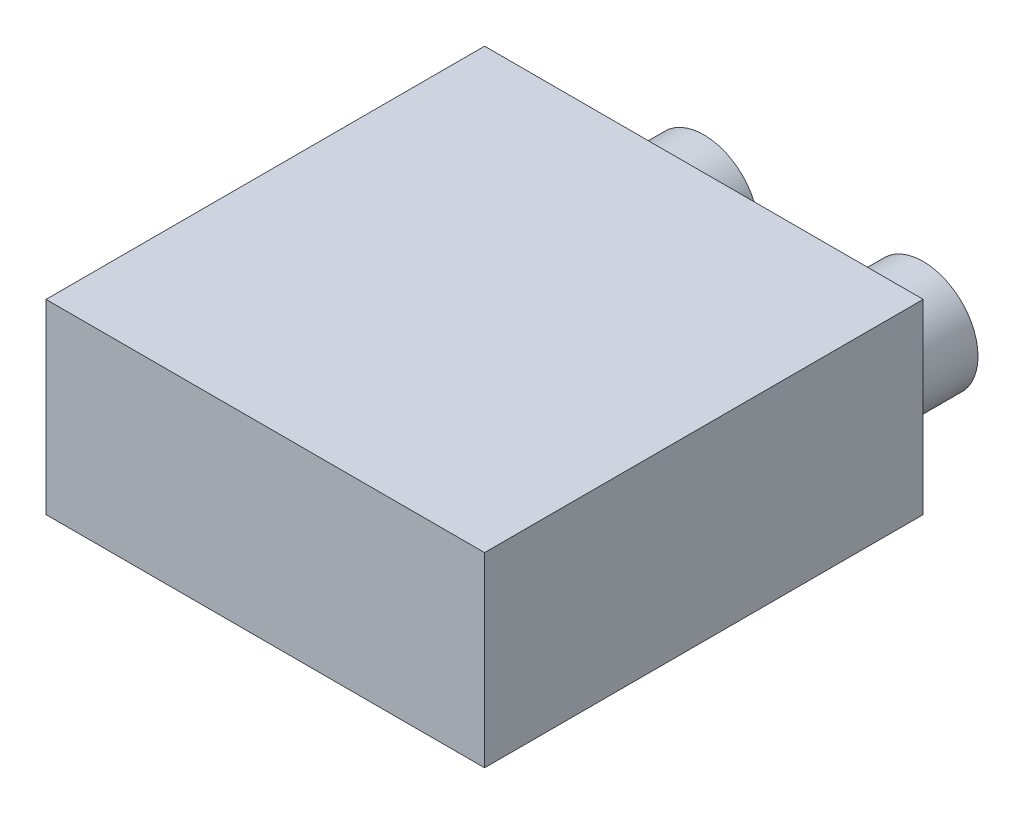
ISO-10303-21;
HEADER;
FILE_DESCRIPTION(('STEP AP214'),'2;1');
FILE_NAME('part.step','',(''),(''),'','','');
FILE_SCHEMA(('AUTOMOTIVE_DESIGN { 1 0 10303 214 1 1 1 1 }'));
ENDSEC;
DATA;
#1=APPLICATION_CONTEXT('core data for automotive mechanical design processes');
#2=APPLICATION_PROTOCOL_DEFINITION('international standard','automotive_design',2000,#1);
#3=PRODUCT_CONTEXT('',#1,'mechanical');
#4=PRODUCT('Part','Part','',(#3));
#5=PRODUCT_RELATED_PRODUCT_CATEGORY('part','',(#4));
#6=PRODUCT_DEFINITION_FORMATION('','',#4);
#7=PRODUCT_DEFINITION_CONTEXT('part definition',#1,'design');
#8=PRODUCT_DEFINITION('design','',#6,#7);
#9=PRODUCT_DEFINITION_SHAPE('','',#8);
#10=(LENGTH_UNIT() NAMED_UNIT(*) SI_UNIT(.MILLI.,.METRE.));
#11=(NAMED_UNIT(*) PLANE_ANGLE_UNIT() SI_UNIT($,.RADIAN.));
#12=(NAMED_UNIT(*) SI_UNIT($,.STERADIAN.) SOLID_ANGLE_UNIT());
#13=UNCERTAINTY_MEASURE_WITH_UNIT(LENGTH_MEASURE(1.E-05),#10,'distance_accuracy_value','');
#14=(GEOMETRIC_REPRESENTATION_CONTEXT(3) GLOBAL_UNCERTAINTY_ASSIGNED_CONTEXT((#13)) GLOBAL_UNIT_ASSIGNED_CONTEXT((#10,
#11,#12)) REPRESENTATION_CONTEXT('',''));
#15=CARTESIAN_POINT('',(0.,0.,0.));
#16=DIRECTION('',(0.,0.,1.));
#17=DIRECTION('',(1.,0.,0.));
#18=AXIS2_PLACEMENT_3D('',#15,#16,#17);
#19=CARTESIAN_POINT('',(20.,17.,-20.));
#20=DIRECTION('',(-1.,0.,0.));
#21=DIRECTION('',(0.,0.,1.));
#22=AXIS2_PLACEMENT_3D('',#19,#20,#21);
#23=PLANE('',#22);
#24=DIRECTION('',(0.,0.,-1.));
#25=VECTOR('',#24,1.);
#26=CARTESIAN_POINT('',(20.,0.,-20.));
#27=LINE('',#26,#25);
#28=CARTESIAN_POINT('',(20.,0.,20.));
#29=VERTEX_POINT('',#28);
#30=CARTESIAN_POINT('',(20.,0.,-20.));
#31=VERTEX_POINT('',#30);
#32=EDGE_CURVE('E105',#29,#31,#27,.T.);
#33=ORIENTED_EDGE('',*,*,#32,.T.);
#34=DIRECTION('',(0.,-1.,0.));
#35=VECTOR('',#34,1.);
#36=CARTESIAN_POINT('',(20.,17.,-20.));
#37=LINE('',#36,#35);
#38=CARTESIAN_POINT('',(20.,17.,-20.));
#39=VERTEX_POINT('',#38);
#40=EDGE_CURVE('E11',#39,#31,#37,.T.);
#41=ORIENTED_EDGE('',*,*,#40,.F.);
#42=DIRECTION('',(0.,0.,-1.));
#43=VECTOR('',#42,1.);
#44=CARTESIAN_POINT('',(20.,17.,-20.));
#45=LINE('',#44,#43);
#46=CARTESIAN_POINT('',(20.,17.,20.));
#47=VERTEX_POINT('',#46);
#48=EDGE_CURVE('E112',#47,#39,#45,.T.);
#49=ORIENTED_EDGE('',*,*,#48,.F.);
#50=DIRECTION('',(0.,-1.,0.));
#51=VECTOR('',#50,1.);
#52=CARTESIAN_POINT('',(20.,17.,20.));
#53=LINE('',#52,#51);
#54=EDGE_CURVE('E115',#47,#29,#53,.T.);
#55=ORIENTED_EDGE('',*,*,#54,.T.);
#56=EDGE_LOOP('',(#33,#41,#49,#55));
#57=FACE_BOUND('',#56,.T.);
#58=ADVANCED_FACE('F37',(#57),#23,.F.);
#59=CARTESIAN_POINT('',(-20.,17.,-20.));
#60=DIRECTION('',(0.,0.,1.));
#61=DIRECTION('',(1.,0.,0.));
#62=AXIS2_PLACEMENT_3D('',#59,#60,#61);
#63=PLANE('',#62);
#64=DIRECTION('',(-1.,0.,0.));
#65=VECTOR('',#64,1.);
#66=CARTESIAN_POINT('',(-20.,0.,-20.));
#67=LINE('',#66,#65);
#68=CARTESIAN_POINT('',(10.,0.,-20.));
#69=VERTEX_POINT('',#68);
#70=EDGE_CURVE('E97',#31,#69,#67,.T.);
#71=ORIENTED_EDGE('',*,*,#70,.T.);
#72=CARTESIAN_POINT('',(10.,5.,-20.));
#73=DIRECTION('',(0.,0.,1.));
#74=DIRECTION('',(1.,0.,0.));
#75=AXIS2_PLACEMENT_3D('',#72,#73,#74);
#76=CIRCLE('',#75,5.);
#77=EDGE_CURVE('E49',#69,#69,#76,.T.);
#78=ORIENTED_EDGE('',*,*,#77,.T.);
#79=CARTESIAN_POINT('',(-10.,0.,-20.));
#80=VERTEX_POINT('',#79);
#81=EDGE_CURVE('E90',#69,#80,#67,.T.);
#82=ORIENTED_EDGE('',*,*,#81,.T.);
#83=CARTESIAN_POINT('',(-10.,5.,-20.));
#84=DIRECTION('',(0.,0.,-1.));
#85=DIRECTION('',(-1.,0.,0.));
#86=AXIS2_PLACEMENT_3D('',#83,#84,#85);
#87=CIRCLE('',#86,5.);
#88=EDGE_CURVE('E95',#80,#80,#87,.T.);
#89=ORIENTED_EDGE('',*,*,#88,.F.);
#90=CARTESIAN_POINT('',(-20.,0.,-20.));
#91=VERTEX_POINT('',#90);
#92=EDGE_CURVE('E98',#80,#91,#67,.T.);
#93=ORIENTED_EDGE('',*,*,#92,.T.);
#94=DIRECTION('',(0.,-1.,0.));
#95=VECTOR('',#94,1.);
#96=CARTESIAN_POINT('',(-20.,17.,-20.));
#97=LINE('',#96,#95);
#98=CARTESIAN_POINT('',(-20.,17.,-20.));
#99=VERTEX_POINT('',#98);
#100=EDGE_CURVE('E44',#99,#91,#97,.T.);
#101=ORIENTED_EDGE('',*,*,#100,.F.);
#102=DIRECTION('',(-1.,0.,0.));
#103=VECTOR('',#102,1.);
#104=CARTESIAN_POINT('',(-20.,17.,-20.));
#105=LINE('',#104,#103);
#106=EDGE_CURVE('E85',#39,#99,#105,.T.);
#107=ORIENTED_EDGE('',*,*,#106,.F.);
#108=ORIENTED_EDGE('',*,*,#40,.T.);
#109=EDGE_LOOP('',(#71,#78,#82,#89,#93,#101,#107,#108));
#110=FACE_BOUND('',#109,.T.);
#111=ADVANCED_FACE('F93',(#110),#63,.F.);
#112=CARTESIAN_POINT('',(-20.,17.,-20.));
#113=DIRECTION('',(1.,0.,0.));
#114=DIRECTION('',(0.,0.,-1.));
#115=AXIS2_PLACEMENT_3D('',#112,#113,#114);
#116=PLANE('',#115);
#117=DIRECTION('',(0.,0.,1.));
#118=VECTOR('',#117,1.);
#119=CARTESIAN_POINT('',(-20.,0.,-20.));
#120=LINE('',#119,#118);
#121=CARTESIAN_POINT('',(-20.,0.,20.));
#122=VERTEX_POINT('',#121);
#123=EDGE_CURVE('E103',#91,#122,#120,.T.);
#124=ORIENTED_EDGE('',*,*,#123,.T.);
#125=DIRECTION('',(0.,-1.,0.));
#126=VECTOR('',#125,1.);
#127=CARTESIAN_POINT('',(-20.,17.,20.));
#128=LINE('',#127,#126);
#129=CARTESIAN_POINT('',(-20.,17.,20.));
#130=VERTEX_POINT('',#129);
#131=EDGE_CURVE('E117',#130,#122,#128,.T.);
#132=ORIENTED_EDGE('',*,*,#131,.F.);
#133=DIRECTION('',(0.,0.,1.));
#134=VECTOR('',#133,1.);
#135=CARTESIAN_POINT('',(-20.,17.,-20.));
#136=LINE('',#135,#134);
#137=EDGE_CURVE('E120',#99,#130,#136,.T.);
#138=ORIENTED_EDGE('',*,*,#137,.F.);
#139=ORIENTED_EDGE('',*,*,#100,.T.);
#140=EDGE_LOOP('',(#124,#132,#138,#139));
#141=FACE_BOUND('',#140,.T.);
#142=ADVANCED_FACE('F119',(#141),#116,.F.);
#143=CARTESIAN_POINT('',(-20.,17.,20.));
#144=DIRECTION('',(0.,0.,-1.));
#145=DIRECTION('',(-1.,0.,0.));
#146=AXIS2_PLACEMENT_3D('',#143,#144,#145);
#147=PLANE('',#146);
#148=DIRECTION('',(1.,0.,0.));
#149=VECTOR('',#148,1.);
#150=CARTESIAN_POINT('',(-20.,0.,20.));
#151=LINE('',#150,#149);
#152=EDGE_CURVE('E78',#122,#29,#151,.T.);
#153=ORIENTED_EDGE('',*,*,#152,.T.);
#154=ORIENTED_EDGE('',*,*,#54,.F.);
#155=DIRECTION('',(1.,0.,0.));
#156=VECTOR('',#155,1.);
#157=CARTESIAN_POINT('',(-20.,17.,20.));
#158=LINE('',#157,#156);
#159=EDGE_CURVE('E57',#130,#47,#158,.T.);
#160=ORIENTED_EDGE('',*,*,#159,.F.);
#161=ORIENTED_EDGE('',*,*,#131,.T.);
#162=EDGE_LOOP('',(#153,#154,#160,#161));
#163=FACE_BOUND('',#162,.T.);
#164=ADVANCED_FACE('F151',(#163),#147,.F.);
#165=CARTESIAN_POINT('',(0.,17.,0.));
#166=DIRECTION('',(0.,1.,0.));
#167=DIRECTION('',(0.,0.,1.));
#168=AXIS2_PLACEMENT_3D('',#165,#166,#167);
#169=PLANE('',#168);
#170=ORIENTED_EDGE('',*,*,#48,.T.);
#171=ORIENTED_EDGE('',*,*,#106,.T.);
#172=ORIENTED_EDGE('',*,*,#137,.T.);
#173=ORIENTED_EDGE('',*,*,#159,.T.);
#174=EDGE_LOOP('',(#170,#171,#172,#173));
#175=FACE_BOUND('',#174,.T.);
#176=ADVANCED_FACE('F153',(#175),#169,.T.);
#177=CARTESIAN_POINT('',(0.,0.,0.));
#178=DIRECTION('',(0.,1.,0.));
#179=DIRECTION('',(0.,0.,1.));
#180=AXIS2_PLACEMENT_3D('',#177,#178,#179);
#181=PLANE('',#180);
#182=ORIENTED_EDGE('',*,*,#32,.F.);
#183=ORIENTED_EDGE('',*,*,#152,.F.);
#184=ORIENTED_EDGE('',*,*,#123,.F.);
#185=ORIENTED_EDGE('',*,*,#92,.F.);
#186=ORIENTED_EDGE('',*,*,#81,.F.);
#187=ORIENTED_EDGE('',*,*,#70,.F.);
#188=EDGE_LOOP('',(#182,#183,#184,#185,#186,#187));
#189=FACE_BOUND('',#188,.T.);
#190=ADVANCED_FACE('F102',(#189),#181,.F.);
#191=CARTESIAN_POINT('',(-10.,5.,-30.));
#192=DIRECTION('',(0.,0.,1.));
#193=DIRECTION('',(1.,0.,0.));
#194=AXIS2_PLACEMENT_3D('',#191,#192,#193);
#195=CYLINDRICAL_SURFACE('',#194,5.);
#196=CARTESIAN_POINT('',(-10.,5.,-30.));
#197=DIRECTION('',(0.,0.,-1.));
#198=DIRECTION('',(-1.,0.,0.));
#199=AXIS2_PLACEMENT_3D('',#196,#197,#198);
#200=CIRCLE('',#199,5.);
#201=CARTESIAN_POINT('',(-15.,5.,-30.));
#202=VERTEX_POINT('',#201);
#203=EDGE_CURVE('E107',#202,#202,#200,.T.);
#204=ORIENTED_EDGE('',*,*,#203,.F.);
#205=EDGE_LOOP('',(#204));
#206=FACE_BOUND('',#205,.T.);
#207=ORIENTED_EDGE('',*,*,#88,.T.);
#208=EDGE_LOOP('',(#207));
#209=FACE_BOUND('',#208,.T.);
#210=ADVANCED_FACE('F163',(#206,#209),#195,.T.);
#211=CARTESIAN_POINT('',(-10.,5.,-30.));
#212=DIRECTION('',(0.,0.,-1.));
#213=DIRECTION('',(-1.,0.,0.));
#214=AXIS2_PLACEMENT_3D('',#211,#212,#213);
#215=PLANE('',#214);
#216=ORIENTED_EDGE('',*,*,#203,.T.);
#217=EDGE_LOOP('',(#216));
#218=FACE_BOUND('',#217,.T.);
#219=ADVANCED_FACE('F142',(#218),#215,.T.);
#220=CARTESIAN_POINT('',(10.,5.,-30.));
#221=DIRECTION('',(0.,0.,1.));
#222=DIRECTION('',(1.,0.,0.));
#223=AXIS2_PLACEMENT_3D('',#220,#221,#222);
#224=CYLINDRICAL_SURFACE('',#223,5.);
#225=CARTESIAN_POINT('',(10.,5.,-30.));
#226=DIRECTION('',(0.,0.,1.));
#227=DIRECTION('',(1.,0.,0.));
#228=AXIS2_PLACEMENT_3D('',#225,#226,#227);
#229=CIRCLE('',#228,5.);
#230=CARTESIAN_POINT('',(15.,5.,-30.));
#231=VERTEX_POINT('',#230);
#232=EDGE_CURVE('E127',#231,#231,#229,.T.);
#233=ORIENTED_EDGE('',*,*,#232,.T.);
#234=EDGE_LOOP('',(#233));
#235=FACE_BOUND('',#234,.T.);
#236=ORIENTED_EDGE('',*,*,#77,.F.);
#237=EDGE_LOOP('',(#236));
#238=FACE_BOUND('',#237,.T.);
#239=ADVANCED_FACE('F134',(#235,#238),#224,.T.);
#240=CARTESIAN_POINT('',(10.,5.,-30.));
#241=DIRECTION('',(0.,0.,-1.));
#242=DIRECTION('',(1.,0.,0.));
#243=AXIS2_PLACEMENT_3D('',#240,#241,#242);
#244=PLANE('',#243);
#245=ORIENTED_EDGE('',*,*,#232,.F.);
#246=EDGE_LOOP('',(#245));
#247=FACE_BOUND('',#246,.T.);
#248=ADVANCED_FACE('F136',(#247),#244,.T.);
#249=CLOSED_SHELL('',(#58,#111,#142,#164,#176,#190,#210,#219,#239,#248));
#250=MANIFOLD_SOLID_BREP('B2',#249);
#251=ADVANCED_BREP_SHAPE_REPRESENTATION('',(#18,#250),#14);
#252=SHAPE_DEFINITION_REPRESENTATION(#9,#251);
ENDSEC;
END-ISO-10303-21;
